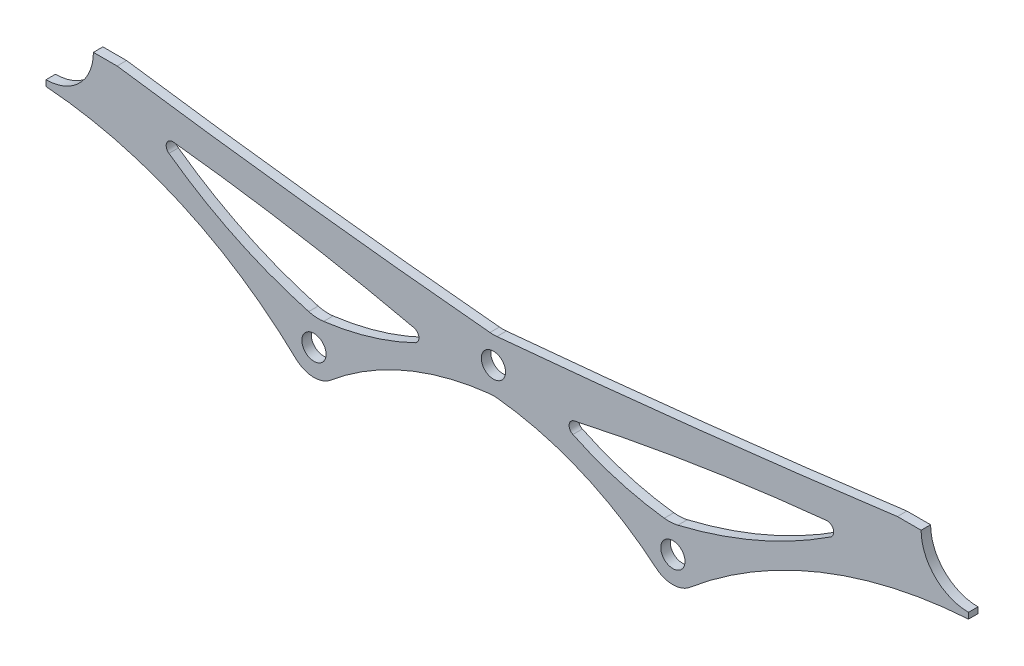
ISO-10303-21;
HEADER;
FILE_DESCRIPTION(('STEP AP214'),'2;1');
FILE_NAME('part.step','',(''),(''),'','','');
FILE_SCHEMA(('AUTOMOTIVE_DESIGN { 1 0 10303 214 1 1 1 1 }'));
ENDSEC;
DATA;
#1=APPLICATION_CONTEXT('core data for automotive mechanical design processes');
#2=APPLICATION_PROTOCOL_DEFINITION('international standard','automotive_design',2000,#1);
#3=PRODUCT_CONTEXT('',#1,'mechanical');
#4=PRODUCT('Part','Part','',(#3));
#5=PRODUCT_RELATED_PRODUCT_CATEGORY('part','',(#4));
#6=PRODUCT_DEFINITION_FORMATION('','',#4);
#7=PRODUCT_DEFINITION_CONTEXT('part definition',#1,'design');
#8=PRODUCT_DEFINITION('design','',#6,#7);
#9=PRODUCT_DEFINITION_SHAPE('','',#8);
#10=(LENGTH_UNIT() NAMED_UNIT(*) SI_UNIT(.MILLI.,.METRE.));
#11=(NAMED_UNIT(*) PLANE_ANGLE_UNIT() SI_UNIT($,.RADIAN.));
#12=(NAMED_UNIT(*) SI_UNIT($,.STERADIAN.) SOLID_ANGLE_UNIT());
#13=UNCERTAINTY_MEASURE_WITH_UNIT(LENGTH_MEASURE(1.E-05),#10,'distance_accuracy_value','');
#14=(GEOMETRIC_REPRESENTATION_CONTEXT(3) GLOBAL_UNCERTAINTY_ASSIGNED_CONTEXT((#13)) GLOBAL_UNIT_ASSIGNED_CONTEXT((#10,
#11,#12)) REPRESENTATION_CONTEXT('',''));
#15=CARTESIAN_POINT('',(0.,0.,0.));
#16=DIRECTION('',(0.,0.,1.));
#17=DIRECTION('',(1.,0.,0.));
#18=AXIS2_PLACEMENT_3D('',#15,#16,#17);
#19=CARTESIAN_POINT('',(-1589.26362340832,394.110715879887,-15.24));
#20=DIRECTION('',(0.,0.,1.));
#21=DIRECTION('',(1.,0.,0.));
#22=AXIS2_PLACEMENT_3D('',#19,#20,#21);
#23=CYLINDRICAL_SURFACE('',#22,79.6451471180553);
#24=CARTESIAN_POINT('',(-1589.26362340832,394.110715879887,-15.24));
#25=DIRECTION('',(0.,0.,1.));
#26=DIRECTION('',(1.,0.,0.));
#27=AXIS2_PLACEMENT_3D('',#24,#25,#26);
#28=CIRCLE('',#27,79.6451471180553);
#29=CARTESIAN_POINT('',(-1579.08751414357,315.118334856851,-15.24));
#30=VERTEX_POINT('',#29);
#31=CARTESIAN_POINT('',(-1554.55386567045,322.42681129012,-15.24));
#32=VERTEX_POINT('',#31);
#33=EDGE_CURVE('E278',#30,#32,#28,.T.);
#34=ORIENTED_EDGE('',*,*,#33,.F.);
#35=DIRECTION('',(0.,0.,1.));
#36=VECTOR('',#35,1.);
#37=CARTESIAN_POINT('',(-1579.08751414357,315.118334856851,-15.24));
#38=LINE('',#37,#36);
#39=CARTESIAN_POINT('',(-1579.08751414357,315.118334856851,-12.7));
#40=VERTEX_POINT('',#39);
#41=EDGE_CURVE('E432',#30,#40,#38,.T.);
#42=ORIENTED_EDGE('',*,*,#41,.T.);
#43=CARTESIAN_POINT('',(-1589.26362340832,394.110715879887,-12.7));
#44=DIRECTION('',(0.,0.,1.));
#45=DIRECTION('',(1.,0.,0.));
#46=AXIS2_PLACEMENT_3D('',#43,#44,#45);
#47=CIRCLE('',#46,79.6451471180553);
#48=CARTESIAN_POINT('',(-1554.55386567045,322.42681129012,-12.7));
#49=VERTEX_POINT('',#48);
#50=EDGE_CURVE('E334',#40,#49,#47,.T.);
#51=ORIENTED_EDGE('',*,*,#50,.T.);
#52=DIRECTION('',(0.,0.,1.));
#53=VECTOR('',#52,1.);
#54=CARTESIAN_POINT('',(-1554.55386567045,322.42681129012,-15.24));
#55=LINE('',#54,#53);
#56=EDGE_CURVE('E393',#49,#32,#55,.F.);
#57=ORIENTED_EDGE('',*,*,#56,.T.);
#58=EDGE_LOOP('',(#34,#42,#51,#57));
#59=FACE_BOUND('',#58,.T.);
#60=ADVANCED_FACE('F36',(#59),#23,.F.);
#61=CARTESIAN_POINT('',(-1682.01321356351,-232.504268770263,-15.24));
#62=DIRECTION('',(0.,0.,1.));
#63=DIRECTION('',(1.,0.,0.));
#64=AXIS2_PLACEMENT_3D('',#61,#62,#63);
#65=CYLINDRICAL_SURFACE('',#64,572.545996749978);
#66=CARTESIAN_POINT('',(-1682.01321356351,-232.504268770263,-15.24));
#67=DIRECTION('',(0.,0.,1.));
#68=DIRECTION('',(1.,0.,0.));
#69=AXIS2_PLACEMENT_3D('',#66,#67,#68);
#70=CIRCLE('',#69,572.545996749978);
#71=CARTESIAN_POINT('',(-1619.30091568319,336.596852375176,-15.24));
#72=VERTEX_POINT('',#71);
#73=CARTESIAN_POINT('',(-1554.93409207859,325.760735754511,-15.24));
#74=VERTEX_POINT('',#73);
#75=EDGE_CURVE('E282',#72,#74,#70,.F.);
#76=ORIENTED_EDGE('',*,*,#75,.T.);
#77=DIRECTION('',(0.,0.,1.));
#78=VECTOR('',#77,1.);
#79=CARTESIAN_POINT('',(-1554.93409207859,325.760735754511,-15.24));
#80=LINE('',#79,#78);
#81=CARTESIAN_POINT('',(-1554.93409207859,325.760735754511,-12.7));
#82=VERTEX_POINT('',#81);
#83=EDGE_CURVE('E390',#74,#82,#80,.T.);
#84=ORIENTED_EDGE('',*,*,#83,.T.);
#85=CARTESIAN_POINT('',(-1682.01321356351,-232.504268770263,-12.7));
#86=DIRECTION('',(0.,0.,1.));
#87=DIRECTION('',(1.,0.,0.));
#88=AXIS2_PLACEMENT_3D('',#85,#86,#87);
#89=CIRCLE('',#88,572.545996749978);
#90=CARTESIAN_POINT('',(-1619.30091568319,336.596852375176,-12.7));
#91=VERTEX_POINT('',#90);
#92=EDGE_CURVE('E338',#91,#82,#89,.F.);
#93=ORIENTED_EDGE('',*,*,#92,.F.);
#94=DIRECTION('',(0.,0.,1.));
#95=VECTOR('',#94,1.);
#96=CARTESIAN_POINT('',(-1619.30091568319,336.596852375176,-15.24));
#97=LINE('',#96,#95);
#98=EDGE_CURVE('E388',#91,#72,#97,.F.);
#99=ORIENTED_EDGE('',*,*,#98,.T.);
#100=EDGE_LOOP('',(#76,#84,#93,#99));
#101=FACE_BOUND('',#100,.T.);
#102=ADVANCED_FACE('F494',(#101),#65,.F.);
#103=CARTESIAN_POINT('',(-1772.00777562842,2986.79725913332,-15.24));
#104=DIRECTION('',(0.,0.,1.));
#105=DIRECTION('',(1.,0.,0.));
#106=AXIS2_PLACEMENT_3D('',#103,#104,#105);
#107=CYLINDRICAL_SURFACE('',#106,2662.74889437228);
#108=CARTESIAN_POINT('',(-1772.00777562842,2986.79725913332,-15.24));
#109=DIRECTION('',(0.,0.,1.));
#110=DIRECTION('',(1.,0.,0.));
#111=AXIS2_PLACEMENT_3D('',#108,#109,#110);
#112=CIRCLE('',#111,2662.74889437228);
#113=CARTESIAN_POINT('',(-1532.65209851228,334.828078634972,-15.24));
#114=VERTEX_POINT('',#113);
#115=CARTESIAN_POINT('',(-1425.35097323638,346.710000000371,-15.24));
#116=VERTEX_POINT('',#115);
#117=EDGE_CURVE('E246',#114,#116,#112,.T.);
#118=ORIENTED_EDGE('',*,*,#117,.F.);
#119=DIRECTION('',(0.,0.,1.));
#120=VECTOR('',#119,1.);
#121=CARTESIAN_POINT('',(-1532.65209851228,334.828078634972,-15.24));
#122=LINE('',#121,#120);
#123=CARTESIAN_POINT('',(-1532.65209851228,334.828078634972,-12.7));
#124=VERTEX_POINT('',#123);
#125=EDGE_CURVE('E418',#114,#124,#122,.T.);
#126=ORIENTED_EDGE('',*,*,#125,.T.);
#127=CARTESIAN_POINT('',(-1772.00777562842,2986.79725913332,-12.7));
#128=DIRECTION('',(0.,0.,1.));
#129=DIRECTION('',(1.,0.,0.));
#130=AXIS2_PLACEMENT_3D('',#127,#128,#129);
#131=CIRCLE('',#130,2662.74889437228);
#132=CARTESIAN_POINT('',(-1425.35097323638,346.710000000371,-12.7));
#133=VERTEX_POINT('',#132);
#134=EDGE_CURVE('E301',#124,#133,#131,.T.);
#135=ORIENTED_EDGE('',*,*,#134,.T.);
#136=DIRECTION('',(0.,0.,1.));
#137=VECTOR('',#136,1.);
#138=CARTESIAN_POINT('',(-1425.35097323638,346.710000000371,-15.24));
#139=LINE('',#138,#137);
#140=EDGE_CURVE('E351',#116,#133,#139,.T.);
#141=ORIENTED_EDGE('',*,*,#140,.F.);
#142=EDGE_LOOP('',(#118,#126,#135,#141));
#143=FACE_BOUND('',#142,.T.);
#144=ADVANCED_FACE('F500',(#143),#107,.F.);
#145=CARTESIAN_POINT('',(0.,346.710000000371,-15.24));
#146=DIRECTION('',(0.,-1.,0.));
#147=DIRECTION('',(0.,0.,-1.));
#148=AXIS2_PLACEMENT_3D('',#145,#146,#147);
#149=PLANE('',#148);
#150=DIRECTION('',(1.,0.,0.));
#151=VECTOR('',#150,1.);
#152=CARTESIAN_POINT('',(0.,346.710000000371,-12.7));
#153=LINE('',#152,#151);
#154=CARTESIAN_POINT('',(-1419.00097323583,346.710000000371,-12.7));
#155=VERTEX_POINT('',#154);
#156=EDGE_CURVE('E332',#133,#155,#153,.T.);
#157=ORIENTED_EDGE('',*,*,#156,.T.);
#158=DIRECTION('',(0.,0.,1.));
#159=VECTOR('',#158,1.);
#160=CARTESIAN_POINT('',(-1419.00097323583,346.710000000371,-15.24));
#161=LINE('',#160,#159);
#162=CARTESIAN_POINT('',(-1419.00097323583,346.710000000371,-15.24));
#163=VERTEX_POINT('',#162);
#164=EDGE_CURVE('E355',#163,#155,#161,.T.);
#165=ORIENTED_EDGE('',*,*,#164,.F.);
#166=DIRECTION('',(1.,0.,0.));
#167=VECTOR('',#166,1.);
#168=CARTESIAN_POINT('',(0.,346.710000000371,-15.24));
#169=LINE('',#168,#167);
#170=EDGE_CURVE('E276',#116,#163,#169,.T.);
#171=ORIENTED_EDGE('',*,*,#170,.F.);
#172=ORIENTED_EDGE('',*,*,#140,.T.);
#173=EDGE_LOOP('',(#157,#165,#171,#172));
#174=FACE_BOUND('',#173,.T.);
#175=ADVANCED_FACE('F507',(#174),#149,.F.);
#176=CARTESIAN_POINT('',(-1406.30097323583,346.710000000371,-15.24));
#177=DIRECTION('',(0.,0.,1.));
#178=DIRECTION('',(1.,0.,0.));
#179=AXIS2_PLACEMENT_3D('',#176,#177,#178);
#180=CYLINDRICAL_SURFACE('',#179,12.7);
#181=CARTESIAN_POINT('',(-1406.30097323583,346.710000000371,-12.7));
#182=DIRECTION('',(0.,0.,1.));
#183=DIRECTION('',(1.,0.,0.));
#184=AXIS2_PLACEMENT_3D('',#181,#182,#183);
#185=CIRCLE('',#184,12.7);
#186=CARTESIAN_POINT('',(-1406.30097323583,334.01000000037,-12.7));
#187=VERTEX_POINT('',#186);
#188=EDGE_CURVE('E330',#155,#187,#185,.T.);
#189=ORIENTED_EDGE('',*,*,#188,.T.);
#190=DIRECTION('',(0.,0.,1.));
#191=VECTOR('',#190,1.);
#192=CARTESIAN_POINT('',(-1406.30097323583,334.01000000037,-15.24));
#193=LINE('',#192,#191);
#194=CARTESIAN_POINT('',(-1406.30097323583,334.01000000037,-15.24));
#195=VERTEX_POINT('',#194);
#196=EDGE_CURVE('E358',#195,#187,#193,.T.);
#197=ORIENTED_EDGE('',*,*,#196,.F.);
#198=CARTESIAN_POINT('',(-1406.30097323583,346.710000000371,-15.24));
#199=DIRECTION('',(0.,0.,1.));
#200=DIRECTION('',(1.,0.,0.));
#201=AXIS2_PLACEMENT_3D('',#198,#199,#200);
#202=CIRCLE('',#201,12.7);
#203=EDGE_CURVE('E274',#163,#195,#202,.T.);
#204=ORIENTED_EDGE('',*,*,#203,.F.);
#205=ORIENTED_EDGE('',*,*,#164,.T.);
#206=EDGE_LOOP('',(#189,#197,#204,#205));
#207=FACE_BOUND('',#206,.T.);
#208=ADVANCED_FACE('F510',(#207),#180,.F.);
#209=CARTESIAN_POINT('',(-1406.30097323588,1.96700185201819E-10,-15.24));
#210=DIRECTION('',(-1.,1.39870617275628E-13,0.));
#211=DIRECTION('',(-1.39870617275628E-13,-1.,0.));
#212=AXIS2_PLACEMENT_3D('',#209,#210,#211);
#213=PLANE('',#212);
#214=DIRECTION('',(-1.39870617275628E-13,-1.,0.));
#215=VECTOR('',#214,1.);
#216=CARTESIAN_POINT('',(-1406.30097323588,1.96700185201819E-10,-12.7));
#217=LINE('',#216,#215);
#218=CARTESIAN_POINT('',(-1406.30097323583,332.422500000371,-12.7));
#219=VERTEX_POINT('',#218);
#220=EDGE_CURVE('E327',#187,#219,#217,.T.);
#221=ORIENTED_EDGE('',*,*,#220,.T.);
#222=DIRECTION('',(0.,0.,1.));
#223=VECTOR('',#222,1.);
#224=CARTESIAN_POINT('',(-1406.30097323583,332.422500000371,-15.24));
#225=LINE('',#224,#223);
#226=CARTESIAN_POINT('',(-1406.30097323583,332.422500000371,-15.24));
#227=VERTEX_POINT('',#226);
#228=EDGE_CURVE('E361',#227,#219,#225,.T.);
#229=ORIENTED_EDGE('',*,*,#228,.F.);
#230=DIRECTION('',(-1.39870617275628E-13,-1.,0.));
#231=VECTOR('',#230,1.);
#232=CARTESIAN_POINT('',(-1406.30097323588,1.96700185201819E-10,-15.24));
#233=LINE('',#232,#231);
#234=EDGE_CURVE('E272',#195,#227,#233,.T.);
#235=ORIENTED_EDGE('',*,*,#234,.F.);
#236=ORIENTED_EDGE('',*,*,#196,.T.);
#237=EDGE_LOOP('',(#221,#229,#235,#236));
#238=FACE_BOUND('',#237,.T.);
#239=ADVANCED_FACE('F514',(#238),#213,.F.);
#240=CARTESIAN_POINT('',(-1398.20656311933,204.191606570756,-15.24));
#241=DIRECTION('',(0.,0.,1.));
#242=DIRECTION('',(1.,0.,0.));
#243=AXIS2_PLACEMENT_3D('',#240,#241,#242);
#244=CYLINDRICAL_SURFACE('',#243,128.486114054754);
#245=CARTESIAN_POINT('',(-1398.20656311933,204.191606570756,-12.7));
#246=DIRECTION('',(0.,0.,1.));
#247=DIRECTION('',(1.,0.,0.));
#248=AXIS2_PLACEMENT_3D('',#245,#246,#247);
#249=CIRCLE('',#248,128.486114054754);
#250=CARTESIAN_POINT('',(-1481.00079913627,302.44533925946,-12.7));
#251=VERTEX_POINT('',#250);
#252=EDGE_CURVE('E324',#251,#219,#249,.F.);
#253=ORIENTED_EDGE('',*,*,#252,.F.);
#254=DIRECTION('',(0.,0.,1.));
#255=VECTOR('',#254,1.);
#256=CARTESIAN_POINT('',(-1481.00079913627,302.44533925946,-15.24));
#257=LINE('',#256,#255);
#258=CARTESIAN_POINT('',(-1481.00079913627,302.44533925946,-15.24));
#259=VERTEX_POINT('',#258);
#260=EDGE_CURVE('E363',#259,#251,#257,.T.);
#261=ORIENTED_EDGE('',*,*,#260,.F.);
#262=CARTESIAN_POINT('',(-1398.20656311933,204.191606570756,-15.24));
#263=DIRECTION('',(0.,0.,1.));
#264=DIRECTION('',(1.,0.,0.));
#265=AXIS2_PLACEMENT_3D('',#262,#263,#264);
#266=CIRCLE('',#265,128.486114054754);
#267=EDGE_CURVE('E269',#259,#227,#266,.F.);
#268=ORIENTED_EDGE('',*,*,#267,.T.);
#269=ORIENTED_EDGE('',*,*,#228,.T.);
#270=EDGE_LOOP('',(#253,#261,#268,#269));
#271=FACE_BOUND('',#270,.T.);
#272=ADVANCED_FACE('F518',(#271),#244,.F.);
#273=CARTESIAN_POINT('',(-1485.51147841381,307.798261120945,-15.24));
#274=DIRECTION('',(0.,0.,1.));
#275=DIRECTION('',(1.,0.,0.));
#276=AXIS2_PLACEMENT_3D('',#273,#274,#275);
#277=CYLINDRICAL_SURFACE('',#276,6.99999999999989);
#278=CARTESIAN_POINT('',(-1485.51147841381,307.798261120945,-12.7));
#279=DIRECTION('',(0.,0.,1.));
#280=DIRECTION('',(1.,0.,0.));
#281=AXIS2_PLACEMENT_3D('',#278,#279,#280);
#282=CIRCLE('',#281,6.99999999999989);
#283=CARTESIAN_POINT('',(-1490.00885770427,302.434160122852,-12.7));
#284=VERTEX_POINT('',#283);
#285=EDGE_CURVE('E321',#284,#251,#282,.T.);
#286=ORIENTED_EDGE('',*,*,#285,.F.);
#287=DIRECTION('',(0.,0.,1.));
#288=VECTOR('',#287,1.);
#289=CARTESIAN_POINT('',(-1490.00885770427,302.434160122852,-15.24));
#290=LINE('',#289,#288);
#291=CARTESIAN_POINT('',(-1490.00885770427,302.434160122852,-15.24));
#292=VERTEX_POINT('',#291);
#293=EDGE_CURVE('E365',#292,#284,#290,.T.);
#294=ORIENTED_EDGE('',*,*,#293,.F.);
#295=CARTESIAN_POINT('',(-1485.51147841381,307.798261120945,-15.24));
#296=DIRECTION('',(0.,0.,1.));
#297=DIRECTION('',(1.,0.,0.));
#298=AXIS2_PLACEMENT_3D('',#295,#296,#297);
#299=CIRCLE('',#298,6.99999999999989);
#300=EDGE_CURVE('E266',#292,#259,#299,.T.);
#301=ORIENTED_EDGE('',*,*,#300,.T.);
#302=ORIENTED_EDGE('',*,*,#260,.T.);
#303=EDGE_LOOP('',(#286,#294,#301,#302));
#304=FACE_BOUND('',#303,.T.);
#305=ADVANCED_FACE('F522',(#304),#277,.T.);
#306=CARTESIAN_POINT('',(-1541.18074424907,241.400578127316,-15.24));
#307=DIRECTION('',(0.,0.,1.));
#308=DIRECTION('',(1.,0.,0.));
#309=AXIS2_PLACEMENT_3D('',#306,#307,#308);
#310=CYLINDRICAL_SURFACE('',#309,79.6470972714014);
#311=CARTESIAN_POINT('',(-1541.18074424907,241.400578127316,-12.7));
#312=DIRECTION('',(0.,0.,1.));
#313=DIRECTION('',(1.,0.,0.));
#314=AXIS2_PLACEMENT_3D('',#311,#312,#313);
#315=CIRCLE('',#314,79.6470972714014);
#316=CARTESIAN_POINT('',(-1532.48591448475,320.571658953142,-12.7));
#317=VERTEX_POINT('',#316);
#318=EDGE_CURVE('E319',#317,#284,#315,.F.);
#319=ORIENTED_EDGE('',*,*,#318,.F.);
#320=DIRECTION('',(0.,0.,1.));
#321=VECTOR('',#320,1.);
#322=CARTESIAN_POINT('',(-1532.48591448475,320.571658953142,-15.24));
#323=LINE('',#322,#321);
#324=CARTESIAN_POINT('',(-1532.48591448475,320.571658953142,-15.24));
#325=VERTEX_POINT('',#324);
#326=EDGE_CURVE('E425',#317,#325,#323,.F.);
#327=ORIENTED_EDGE('',*,*,#326,.T.);
#328=CARTESIAN_POINT('',(-1541.18074424907,241.400578127316,-15.24));
#329=DIRECTION('',(0.,0.,1.));
#330=DIRECTION('',(1.,0.,0.));
#331=AXIS2_PLACEMENT_3D('',#328,#329,#330);
#332=CIRCLE('',#331,79.6470972714014);
#333=EDGE_CURVE('E264',#325,#292,#332,.F.);
#334=ORIENTED_EDGE('',*,*,#333,.T.);
#335=ORIENTED_EDGE('',*,*,#293,.T.);
#336=EDGE_LOOP('',(#319,#327,#334,#335));
#337=FACE_BOUND('',#336,.T.);
#338=ADVANCED_FACE('F526',(#337),#310,.F.);
#339=CARTESIAN_POINT('',(-1526.00944124424,241.402530743223,-15.24));
#340=DIRECTION('',(0.,0.,1.));
#341=DIRECTION('',(1.,0.,0.));
#342=AXIS2_PLACEMENT_3D('',#339,#340,#341);
#343=CYLINDRICAL_SURFACE('',#342,79.645147118986);
#344=CARTESIAN_POINT('',(-1526.00944124424,241.402530743223,-15.24));
#345=DIRECTION('',(0.,0.,1.));
#346=DIRECTION('',(1.,0.,0.));
#347=AXIS2_PLACEMENT_3D('',#344,#345,#346);
#348=CIRCLE('',#347,79.645147118986);
#349=CARTESIAN_POINT('',(-1577.18057721237,302.434197141382,-15.24));
#350=VERTEX_POINT('',#349);
#351=CARTESIAN_POINT('',(-1534.70420547118,320.571656888728,-15.24));
#352=VERTEX_POINT('',#351);
#353=EDGE_CURVE('E261',#350,#352,#348,.F.);
#354=ORIENTED_EDGE('',*,*,#353,.T.);
#355=DIRECTION('',(0.,0.,1.));
#356=VECTOR('',#355,1.);
#357=CARTESIAN_POINT('',(-1534.70420547118,320.571656888728,-15.24));
#358=LINE('',#357,#356);
#359=CARTESIAN_POINT('',(-1534.70420547118,320.571656888728,-12.7));
#360=VERTEX_POINT('',#359);
#361=EDGE_CURVE('E422',#352,#360,#358,.T.);
#362=ORIENTED_EDGE('',*,*,#361,.T.);
#363=CARTESIAN_POINT('',(-1526.00944124424,241.402530743223,-12.7));
#364=DIRECTION('',(0.,0.,1.));
#365=DIRECTION('',(1.,0.,0.));
#366=AXIS2_PLACEMENT_3D('',#363,#364,#365);
#367=CIRCLE('',#366,79.645147118986);
#368=CARTESIAN_POINT('',(-1577.18057721237,302.434197141382,-12.7));
#369=VERTEX_POINT('',#368);
#370=EDGE_CURVE('E316',#369,#360,#367,.F.);
#371=ORIENTED_EDGE('',*,*,#370,.F.);
#372=DIRECTION('',(0.,0.,1.));
#373=VECTOR('',#372,1.);
#374=CARTESIAN_POINT('',(-1577.18057721237,302.434197141382,-15.24));
#375=LINE('',#374,#373);
#376=EDGE_CURVE('E368',#350,#369,#375,.T.);
#377=ORIENTED_EDGE('',*,*,#376,.F.);
#378=EDGE_LOOP('',(#354,#362,#371,#377));
#379=FACE_BOUND('',#378,.T.);
#380=ADVANCED_FACE('F530',(#379),#343,.F.);
#381=CARTESIAN_POINT('',(-1581.6780006554,307.798261120682,-15.24));
#382=DIRECTION('',(0.,0.,1.));
#383=DIRECTION('',(1.,0.,0.));
#384=AXIS2_PLACEMENT_3D('',#381,#382,#383);
#385=CYLINDRICAL_SURFACE('',#384,6.99999999999992);
#386=CARTESIAN_POINT('',(-1581.6780006554,307.798261120682,-12.7));
#387=DIRECTION('',(0.,0.,1.));
#388=DIRECTION('',(1.,0.,0.));
#389=AXIS2_PLACEMENT_3D('',#386,#387,#388);
#390=CIRCLE('',#389,6.99999999999992);
#391=CARTESIAN_POINT('',(-1586.50049981143,302.724455656326,-12.7));
#392=VERTEX_POINT('',#391);
#393=EDGE_CURVE('E313',#392,#369,#390,.T.);
#394=ORIENTED_EDGE('',*,*,#393,.F.);
#395=DIRECTION('',(0.,0.,1.));
#396=VECTOR('',#395,1.);
#397=CARTESIAN_POINT('',(-1586.50049981143,302.724455656326,-15.24));
#398=LINE('',#397,#396);
#399=CARTESIAN_POINT('',(-1586.50049981143,302.724455656326,-15.24));
#400=VERTEX_POINT('',#399);
#401=EDGE_CURVE('E370',#400,#392,#398,.T.);
#402=ORIENTED_EDGE('',*,*,#401,.F.);
#403=CARTESIAN_POINT('',(-1581.6780006554,307.798261120682,-15.24));
#404=DIRECTION('',(0.,0.,1.));
#405=DIRECTION('',(1.,0.,0.));
#406=AXIS2_PLACEMENT_3D('',#403,#404,#405);
#407=CIRCLE('',#406,6.99999999999992);
#408=EDGE_CURVE('E258',#400,#350,#407,.T.);
#409=ORIENTED_EDGE('',*,*,#408,.T.);
#410=ORIENTED_EDGE('',*,*,#376,.T.);
#411=EDGE_LOOP('',(#394,#402,#409,#410));
#412=FACE_BOUND('',#411,.T.);
#413=ADVANCED_FACE('F534',(#412),#385,.T.);
#414=CARTESIAN_POINT('',(-1661.61634272742,223.694234619835,-15.24));
#415=DIRECTION('',(0.,0.,1.));
#416=DIRECTION('',(1.,0.,0.));
#417=AXIS2_PLACEMENT_3D('',#414,#415,#416);
#418=CYLINDRICAL_SURFACE('',#417,109.032865201537);
#419=CARTESIAN_POINT('',(-1661.61634272742,223.694234619835,-12.7));
#420=DIRECTION('',(0.,0.,1.));
#421=DIRECTION('',(1.,0.,0.));
#422=AXIS2_PLACEMENT_3D('',#419,#420,#421);
#423=CIRCLE('',#422,109.032865201537);
#424=CARTESIAN_POINT('',(-1653.4720194654,332.422500000371,-12.7));
#425=VERTEX_POINT('',#424);
#426=EDGE_CURVE('E310',#425,#392,#423,.F.);
#427=ORIENTED_EDGE('',*,*,#426,.F.);
#428=DIRECTION('',(0.,0.,1.));
#429=VECTOR('',#428,1.);
#430=CARTESIAN_POINT('',(-1653.4720194654,332.422500000371,-15.24));
#431=LINE('',#430,#429);
#432=CARTESIAN_POINT('',(-1653.4720194654,332.422500000371,-15.24));
#433=VERTEX_POINT('',#432);
#434=EDGE_CURVE('E372',#433,#425,#431,.T.);
#435=ORIENTED_EDGE('',*,*,#434,.F.);
#436=CARTESIAN_POINT('',(-1661.61634272742,223.694234619835,-15.24));
#437=DIRECTION('',(0.,0.,1.));
#438=DIRECTION('',(1.,0.,0.));
#439=AXIS2_PLACEMENT_3D('',#436,#437,#438);
#440=CIRCLE('',#439,109.032865201537);
#441=EDGE_CURVE('E255',#433,#400,#440,.F.);
#442=ORIENTED_EDGE('',*,*,#441,.T.);
#443=ORIENTED_EDGE('',*,*,#401,.T.);
#444=EDGE_LOOP('',(#427,#435,#442,#443));
#445=FACE_BOUND('',#444,.T.);
#446=ADVANCED_FACE('F538',(#445),#418,.F.);
#447=CARTESIAN_POINT('',(-1653.4720194654,0.,-15.24));
#448=DIRECTION('',(1.,0.,0.));
#449=DIRECTION('',(0.,0.,-1.));
#450=AXIS2_PLACEMENT_3D('',#447,#448,#449);
#451=PLANE('',#450);
#452=DIRECTION('',(0.,1.,0.));
#453=VECTOR('',#452,1.);
#454=CARTESIAN_POINT('',(-1653.4720194654,0.,-12.7));
#455=LINE('',#454,#453);
#456=CARTESIAN_POINT('',(-1653.4720194654,334.009999999825,-12.7));
#457=VERTEX_POINT('',#456);
#458=EDGE_CURVE('E308',#425,#457,#455,.T.);
#459=ORIENTED_EDGE('',*,*,#458,.T.);
#460=DIRECTION('',(0.,0.,1.));
#461=VECTOR('',#460,1.);
#462=CARTESIAN_POINT('',(-1653.4720194654,334.009999999825,-15.24));
#463=LINE('',#462,#461);
#464=CARTESIAN_POINT('',(-1653.4720194654,334.009999999825,-15.24));
#465=VERTEX_POINT('',#464);
#466=EDGE_CURVE('E374',#465,#457,#463,.T.);
#467=ORIENTED_EDGE('',*,*,#466,.F.);
#468=DIRECTION('',(0.,1.,0.));
#469=VECTOR('',#468,1.);
#470=CARTESIAN_POINT('',(-1653.4720194654,0.,-15.24));
#471=LINE('',#470,#469);
#472=EDGE_CURVE('E253',#433,#465,#471,.T.);
#473=ORIENTED_EDGE('',*,*,#472,.F.);
#474=ORIENTED_EDGE('',*,*,#434,.T.);
#475=EDGE_LOOP('',(#459,#467,#473,#474));
#476=FACE_BOUND('',#475,.T.);
#477=ADVANCED_FACE('F542',(#476),#451,.F.);
#478=CARTESIAN_POINT('',(-1653.4720194654,346.710000000371,-15.24));
#479=DIRECTION('',(0.,0.,1.));
#480=DIRECTION('',(1.,0.,0.));
#481=AXIS2_PLACEMENT_3D('',#478,#479,#480);
#482=CYLINDRICAL_SURFACE('',#481,12.7000000005457);
#483=CARTESIAN_POINT('',(-1653.4720194654,346.710000000371,-12.7));
#484=DIRECTION('',(0.,0.,1.));
#485=DIRECTION('',(1.,0.,0.));
#486=AXIS2_PLACEMENT_3D('',#483,#484,#485);
#487=CIRCLE('',#486,12.7000000005457);
#488=CARTESIAN_POINT('',(-1640.77201946486,346.710000000371,-12.7));
#489=VERTEX_POINT('',#488);
#490=EDGE_CURVE('E306',#457,#489,#487,.T.);
#491=ORIENTED_EDGE('',*,*,#490,.T.);
#492=DIRECTION('',(0.,0.,1.));
#493=VECTOR('',#492,1.);
#494=CARTESIAN_POINT('',(-1640.77201946486,346.710000000371,-15.24));
#495=LINE('',#494,#493);
#496=CARTESIAN_POINT('',(-1640.77201946486,346.710000000371,-15.24));
#497=VERTEX_POINT('',#496);
#498=EDGE_CURVE('E240',#497,#489,#495,.T.);
#499=ORIENTED_EDGE('',*,*,#498,.F.);
#500=CARTESIAN_POINT('',(-1653.4720194654,346.710000000371,-15.24));
#501=DIRECTION('',(0.,0.,1.));
#502=DIRECTION('',(1.,0.,0.));
#503=AXIS2_PLACEMENT_3D('',#500,#501,#502);
#504=CIRCLE('',#503,12.7000000005457);
#505=EDGE_CURVE('E227',#465,#497,#504,.T.);
#506=ORIENTED_EDGE('',*,*,#505,.F.);
#507=ORIENTED_EDGE('',*,*,#466,.T.);
#508=EDGE_LOOP('',(#491,#499,#506,#507));
#509=FACE_BOUND('',#508,.T.);
#510=ADVANCED_FACE('F546',(#509),#482,.F.);
#511=CARTESIAN_POINT('',(3.03090885722975E-12,346.710000000356,-15.24));
#512=DIRECTION('',(0.,-1.,0.));
#513=DIRECTION('',(1.,0.,0.));
#514=AXIS2_PLACEMENT_3D('',#511,#512,#513);
#515=PLANE('',#514);
#516=DIRECTION('',(1.,0.,0.));
#517=VECTOR('',#516,1.);
#518=CARTESIAN_POINT('',(3.03090885722975E-12,346.710000000356,-12.7));
#519=LINE('',#518,#517);
#520=CARTESIAN_POINT('',(-1634.42201946486,346.71000000037,-12.7));
#521=VERTEX_POINT('',#520);
#522=EDGE_CURVE('E236',#489,#521,#519,.T.);
#523=ORIENTED_EDGE('',*,*,#522,.T.);
#524=DIRECTION('',(0.,0.,1.));
#525=VECTOR('',#524,1.);
#526=CARTESIAN_POINT('',(-1634.42201946486,346.71000000037,-15.24));
#527=LINE('',#526,#525);
#528=CARTESIAN_POINT('',(-1634.42201946486,346.71000000037,-15.24));
#529=VERTEX_POINT('',#528);
#530=EDGE_CURVE('E233',#529,#521,#527,.T.);
#531=ORIENTED_EDGE('',*,*,#530,.F.);
#532=DIRECTION('',(1.,0.,0.));
#533=VECTOR('',#532,1.);
#534=CARTESIAN_POINT('',(3.03090885722975E-12,346.710000000356,-15.24));
#535=LINE('',#534,#533);
#536=EDGE_CURVE('E219',#497,#529,#535,.T.);
#537=ORIENTED_EDGE('',*,*,#536,.F.);
#538=ORIENTED_EDGE('',*,*,#498,.T.);
#539=EDGE_LOOP('',(#523,#531,#537,#538));
#540=FACE_BOUND('',#539,.T.);
#541=ADVANCED_FACE('F234',(#540),#515,.F.);
#542=CARTESIAN_POINT('',(-1514.7038691118,441.797040508538,-15.24));
#543=DIRECTION('',(0.,0.,1.));
#544=DIRECTION('',(1.,0.,0.));
#545=AXIS2_PLACEMENT_3D('',#542,#543,#544);
#546=CYLINDRICAL_SURFACE('',#545,130.141782663455);
#547=CARTESIAN_POINT('',(-1514.7038691118,441.797040508538,-15.24));
#548=DIRECTION('',(0.,0.,1.));
#549=DIRECTION('',(1.,0.,0.));
#550=AXIS2_PLACEMENT_3D('',#547,#548,#549);
#551=CIRCLE('',#550,130.141782663455);
#552=CARTESIAN_POINT('',(-1484.17292928241,315.287178015703,-15.24));
#553=VERTEX_POINT('',#552);
#554=CARTESIAN_POINT('',(-1443.22328265019,333.043146996968,-15.24));
#555=VERTEX_POINT('',#554);
#556=EDGE_CURVE('E350',#553,#555,#551,.T.);
#557=ORIENTED_EDGE('',*,*,#556,.F.);
#558=DIRECTION('',(0.,0.,1.));
#559=VECTOR('',#558,1.);
#560=CARTESIAN_POINT('',(-1484.17292928241,315.287178015703,-15.24));
#561=LINE('',#560,#559);
#562=CARTESIAN_POINT('',(-1484.17292928241,315.287178015703,-12.7));
#563=VERTEX_POINT('',#562);
#564=EDGE_CURVE('E427',#553,#563,#561,.T.);
#565=ORIENTED_EDGE('',*,*,#564,.T.);
#566=CARTESIAN_POINT('',(-1514.7038691118,441.797040508538,-12.7));
#567=DIRECTION('',(0.,0.,1.));
#568=DIRECTION('',(1.,0.,0.));
#569=AXIS2_PLACEMENT_3D('',#566,#567,#568);
#570=CIRCLE('',#569,130.141782663455);
#571=CARTESIAN_POINT('',(-1443.22328265019,333.043146996968,-12.7));
#572=VERTEX_POINT('',#571);
#573=EDGE_CURVE('E293',#563,#572,#570,.T.);
#574=ORIENTED_EDGE('',*,*,#573,.T.);
#575=DIRECTION('',(0.,0.,1.));
#576=VECTOR('',#575,1.);
#577=CARTESIAN_POINT('',(-1443.22328265019,333.043146996968,-15.24));
#578=LINE('',#577,#576);
#579=EDGE_CURVE('E382',#572,#555,#578,.F.);
#580=ORIENTED_EDGE('',*,*,#579,.T.);
#581=EDGE_LOOP('',(#557,#565,#574,#580));
#582=FACE_BOUND('',#581,.T.);
#583=ADVANCED_FACE('F457',(#582),#546,.F.);
#584=CARTESIAN_POINT('',(-1383.73517132049,-265.718137051282,-15.24));
#585=DIRECTION('',(0.,0.,1.));
#586=DIRECTION('',(1.,0.,0.));
#587=AXIS2_PLACEMENT_3D('',#584,#585,#586);
#588=CYLINDRICAL_SURFACE('',#587,605.062789571794);
#589=CARTESIAN_POINT('',(-1383.73517132049,-265.718137051282,-15.24));
#590=DIRECTION('',(0.,0.,1.));
#591=DIRECTION('',(1.,0.,0.));
#592=AXIS2_PLACEMENT_3D('',#589,#590,#591);
#593=CIRCLE('',#592,605.062789571794);
#594=CARTESIAN_POINT('',(-1444.37805346476,336.297992441639,-15.24));
#595=VERTEX_POINT('',#594);
#596=CARTESIAN_POINT('',(-1511.91831479088,325.610926207451,-15.24));
#597=VERTEX_POINT('',#596);
#598=EDGE_CURVE('E248',#595,#597,#593,.T.);
#599=ORIENTED_EDGE('',*,*,#598,.F.);
#600=DIRECTION('',(0.,0.,1.));
#601=VECTOR('',#600,1.);
#602=CARTESIAN_POINT('',(-1444.37805346476,336.29799244164,-15.24));
#603=LINE('',#602,#601);
#604=CARTESIAN_POINT('',(-1444.37805346476,336.297992441639,-12.7));
#605=VERTEX_POINT('',#604);
#606=EDGE_CURVE('E379',#595,#605,#603,.T.);
#607=ORIENTED_EDGE('',*,*,#606,.T.);
#608=CARTESIAN_POINT('',(-1383.73517132049,-265.718137051282,-12.7));
#609=DIRECTION('',(0.,0.,1.));
#610=DIRECTION('',(1.,0.,0.));
#611=AXIS2_PLACEMENT_3D('',#608,#609,#610);
#612=CIRCLE('',#611,605.062789571794);
#613=CARTESIAN_POINT('',(-1511.91831479088,325.610926207451,-12.7));
#614=VERTEX_POINT('',#613);
#615=EDGE_CURVE('E298',#605,#614,#612,.T.);
#616=ORIENTED_EDGE('',*,*,#615,.T.);
#617=DIRECTION('',(0.,0.,1.));
#618=VECTOR('',#617,1.);
#619=CARTESIAN_POINT('',(-1511.91831479088,325.610926207451,-15.24));
#620=LINE('',#619,#618);
#621=EDGE_CURVE('E354',#614,#597,#620,.F.);
#622=ORIENTED_EDGE('',*,*,#621,.T.);
#623=EDGE_LOOP('',(#599,#607,#616,#622));
#624=FACE_BOUND('',#623,.T.);
#625=ADVANCED_FACE('F477',(#624),#588,.F.);
#626=CARTESIAN_POINT('',(-1533.59506399725,327.714985503354,-15.24));
#627=DIRECTION('',(0.,0.,1.));
#628=DIRECTION('',(1.,0.,0.));
#629=AXIS2_PLACEMENT_3D('',#626,#627,#628);
#630=CYLINDRICAL_SURFACE('',#629,3.25000000204203);
#631=CARTESIAN_POINT('',(-1533.59506399725,327.714985503354,-15.24));
#632=DIRECTION('',(0.,0.,1.));
#633=DIRECTION('',(1.,0.,0.));
#634=AXIS2_PLACEMENT_3D('',#631,#632,#633);
#635=CIRCLE('',#634,3.25000000204203);
#636=CARTESIAN_POINT('',(-1530.34506399521,327.714985503354,-15.24));
#637=VERTEX_POINT('',#636);
#638=EDGE_CURVE('E288',#637,#637,#635,.T.);
#639=ORIENTED_EDGE('',*,*,#638,.F.);
#640=EDGE_LOOP('',(#639));
#641=FACE_BOUND('',#640,.T.);
#642=CARTESIAN_POINT('',(-1533.59506399725,327.714985503354,-12.7));
#643=DIRECTION('',(0.,0.,1.));
#644=DIRECTION('',(1.,0.,0.));
#645=AXIS2_PLACEMENT_3D('',#642,#643,#644);
#646=CIRCLE('',#645,3.25000000204203);
#647=CARTESIAN_POINT('',(-1530.34506399521,327.714985503354,-12.7));
#648=VERTEX_POINT('',#647);
#649=EDGE_CURVE('E344',#648,#648,#646,.T.);
#650=ORIENTED_EDGE('',*,*,#649,.T.);
#651=EDGE_LOOP('',(#650));
#652=FACE_BOUND('',#651,.T.);
#653=ADVANCED_FACE('F560',(#641,#652),#630,.F.);
#654=CARTESIAN_POINT('',(-1485.51147841381,307.798261120945,-15.24));
#655=DIRECTION('',(0.,0.,1.));
#656=DIRECTION('',(1.,0.,0.));
#657=AXIS2_PLACEMENT_3D('',#654,#655,#656);
#658=CYLINDRICAL_SURFACE('',#657,3.24999999971178);
#659=CARTESIAN_POINT('',(-1485.51147841381,307.798261120945,-15.24));
#660=DIRECTION('',(0.,0.,1.));
#661=DIRECTION('',(1.,0.,0.));
#662=AXIS2_PLACEMENT_3D('',#659,#660,#661);
#663=CIRCLE('',#662,3.24999999971178);
#664=CARTESIAN_POINT('',(-1482.2614784141,307.798261120945,-15.24));
#665=VERTEX_POINT('',#664);
#666=EDGE_CURVE('E285',#665,#665,#663,.T.);
#667=ORIENTED_EDGE('',*,*,#666,.F.);
#668=EDGE_LOOP('',(#667));
#669=FACE_BOUND('',#668,.T.);
#670=CARTESIAN_POINT('',(-1485.51147841381,307.798261120945,-12.7));
#671=DIRECTION('',(0.,0.,1.));
#672=DIRECTION('',(1.,0.,0.));
#673=AXIS2_PLACEMENT_3D('',#670,#671,#672);
#674=CIRCLE('',#673,3.24999999971178);
#675=CARTESIAN_POINT('',(-1482.2614784141,307.798261120945,-12.7));
#676=VERTEX_POINT('',#675);
#677=EDGE_CURVE('E341',#676,#676,#674,.T.);
#678=ORIENTED_EDGE('',*,*,#677,.T.);
#679=EDGE_LOOP('',(#678));
#680=FACE_BOUND('',#679,.T.);
#681=ADVANCED_FACE('F581',(#669,#680),#658,.F.);
#682=CARTESIAN_POINT('',(-1551.97871667553,428.146769246531,-15.24));
#683=DIRECTION('',(0.,0.,1.));
#684=DIRECTION('',(1.,0.,0.));
#685=AXIS2_PLACEMENT_3D('',#682,#683,#684);
#686=CYLINDRICAL_SURFACE('',#685,116.958908018375);
#687=CARTESIAN_POINT('',(-1551.97871667553,428.146769246531,-12.7));
#688=DIRECTION('',(0.,0.,1.));
#689=DIRECTION('',(1.,0.,0.));
#690=AXIS2_PLACEMENT_3D('',#687,#688,#689);
#691=CIRCLE('',#690,116.958908018375);
#692=CARTESIAN_POINT('',(-1583.08804697381,315.401056542042,-12.7));
#693=VERTEX_POINT('',#692);
#694=CARTESIAN_POINT('',(-1620.5378953395,333.389050902472,-12.7));
#695=VERTEX_POINT('',#694);
#696=EDGE_CURVE('E336',#693,#695,#691,.F.);
#697=ORIENTED_EDGE('',*,*,#696,.F.);
#698=DIRECTION('',(0.,0.,1.));
#699=VECTOR('',#698,1.);
#700=CARTESIAN_POINT('',(-1583.08804697381,315.401056542042,-15.24));
#701=LINE('',#700,#699);
#702=CARTESIAN_POINT('',(-1583.08804697381,315.401056542042,-15.24));
#703=VERTEX_POINT('',#702);
#704=EDGE_CURVE('E57',#693,#703,#701,.F.);
#705=ORIENTED_EDGE('',*,*,#704,.T.);
#706=CARTESIAN_POINT('',(-1551.97871667553,428.146769246531,-15.24));
#707=DIRECTION('',(0.,0.,1.));
#708=DIRECTION('',(1.,0.,0.));
#709=AXIS2_PLACEMENT_3D('',#706,#707,#708);
#710=CIRCLE('',#709,116.958908018375);
#711=CARTESIAN_POINT('',(-1620.5378953395,333.389050902472,-15.24));
#712=VERTEX_POINT('',#711);
#713=EDGE_CURVE('E280',#703,#712,#710,.F.);
#714=ORIENTED_EDGE('',*,*,#713,.T.);
#715=DIRECTION('',(0.,0.,1.));
#716=VECTOR('',#715,1.);
#717=CARTESIAN_POINT('',(-1620.5378953395,333.389050902472,-15.24));
#718=LINE('',#717,#716);
#719=EDGE_CURVE('E396',#712,#695,#718,.T.);
#720=ORIENTED_EDGE('',*,*,#719,.T.);
#721=EDGE_LOOP('',(#697,#705,#714,#720));
#722=FACE_BOUND('',#721,.T.);
#723=ADVANCED_FACE('F506',(#722),#686,.F.);
#724=CARTESIAN_POINT('',(-1344.94590531772,2355.32092590507,-15.24));
#725=DIRECTION('',(0.,0.,1.));
#726=DIRECTION('',(1.,0.,0.));
#727=AXIS2_PLACEMENT_3D('',#724,#725,#726);
#728=CYLINDRICAL_SURFACE('',#727,2029.36302132602);
#729=CARTESIAN_POINT('',(-1344.94590531772,2355.32092590507,-12.7));
#730=DIRECTION('',(0.,0.,1.));
#731=DIRECTION('',(1.,0.,0.));
#732=AXIS2_PLACEMENT_3D('',#729,#730,#731);
#733=CIRCLE('',#732,2029.36302132602);
#734=CARTESIAN_POINT('',(-1534.51445982169,334.831372487697,-12.7));
#735=VERTEX_POINT('',#734);
#736=EDGE_CURVE('E303',#521,#735,#733,.T.);
#737=ORIENTED_EDGE('',*,*,#736,.T.);
#738=DIRECTION('',(0.,0.,1.));
#739=VECTOR('',#738,1.);
#740=CARTESIAN_POINT('',(-1534.51445982169,334.831372487697,-15.24));
#741=LINE('',#740,#739);
#742=CARTESIAN_POINT('',(-1534.51445982169,334.831372487697,-15.24));
#743=VERTEX_POINT('',#742);
#744=EDGE_CURVE('E245',#735,#743,#741,.F.);
#745=ORIENTED_EDGE('',*,*,#744,.T.);
#746=CARTESIAN_POINT('',(-1344.94590531772,2355.32092590507,-15.24));
#747=DIRECTION('',(0.,0.,1.));
#748=DIRECTION('',(1.,0.,0.));
#749=AXIS2_PLACEMENT_3D('',#746,#747,#748);
#750=CIRCLE('',#749,2029.36302132602);
#751=EDGE_CURVE('E224',#529,#743,#750,.T.);
#752=ORIENTED_EDGE('',*,*,#751,.F.);
#753=ORIENTED_EDGE('',*,*,#530,.T.);
#754=EDGE_LOOP('',(#737,#745,#752,#753));
#755=FACE_BOUND('',#754,.T.);
#756=ADVANCED_FACE('F243',(#755),#728,.F.);
#757=CARTESIAN_POINT('',(-1477.92579816198,394.112668496984,-15.24));
#758=DIRECTION('',(0.,0.,1.));
#759=DIRECTION('',(1.,0.,0.));
#760=AXIS2_PLACEMENT_3D('',#757,#758,#759);
#761=CYLINDRICAL_SURFACE('',#760,79.6470972714022);
#762=CARTESIAN_POINT('',(-1477.92579816198,394.112668496984,-12.7));
#763=DIRECTION('',(0.,0.,1.));
#764=DIRECTION('',(1.,0.,0.));
#765=AXIS2_PLACEMENT_3D('',#762,#763,#764);
#766=CIRCLE('',#765,79.6470972714022);
#767=CARTESIAN_POINT('',(-1512.30920078826,322.269493959663,-12.7));
#768=VERTEX_POINT('',#767);
#769=CARTESIAN_POINT('',(-1487.81836248094,315.082311829717,-12.7));
#770=VERTEX_POINT('',#769);
#771=EDGE_CURVE('E295',#768,#770,#766,.T.);
#772=ORIENTED_EDGE('',*,*,#771,.T.);
#773=DIRECTION('',(0.,0.,1.));
#774=VECTOR('',#773,1.);
#775=CARTESIAN_POINT('',(-1487.81836248094,315.082311829717,-15.24));
#776=LINE('',#775,#774);
#777=CARTESIAN_POINT('',(-1487.81836248094,315.082311829717,-15.24));
#778=VERTEX_POINT('',#777);
#779=EDGE_CURVE('E430',#770,#778,#776,.F.);
#780=ORIENTED_EDGE('',*,*,#779,.T.);
#781=CARTESIAN_POINT('',(-1477.92579816198,394.112668496984,-15.24));
#782=DIRECTION('',(0.,0.,1.));
#783=DIRECTION('',(1.,0.,0.));
#784=AXIS2_PLACEMENT_3D('',#781,#782,#783);
#785=CIRCLE('',#784,79.6470972714022);
#786=CARTESIAN_POINT('',(-1512.30920078826,322.269493959663,-15.24));
#787=VERTEX_POINT('',#786);
#788=EDGE_CURVE('E452',#787,#778,#785,.T.);
#789=ORIENTED_EDGE('',*,*,#788,.F.);
#790=DIRECTION('',(0.,0.,1.));
#791=VECTOR('',#790,1.);
#792=CARTESIAN_POINT('',(-1512.30920078826,322.269493959663,-15.24));
#793=LINE('',#792,#791);
#794=EDGE_CURVE('E385',#787,#768,#793,.T.);
#795=ORIENTED_EDGE('',*,*,#794,.T.);
#796=EDGE_LOOP('',(#772,#780,#789,#795));
#797=FACE_BOUND('',#796,.T.);
#798=ADVANCED_FACE('F468',(#797),#761,.F.);
#799=CARTESIAN_POINT('',(-1581.67800065536,307.798261120682,-15.24));
#800=DIRECTION('',(0.,0.,1.));
#801=DIRECTION('',(1.,0.,0.));
#802=AXIS2_PLACEMENT_3D('',#799,#800,#801);
#803=CYLINDRICAL_SURFACE('',#802,3.24999999995427);
#804=CARTESIAN_POINT('',(-1581.67800065536,307.798261120682,-15.24));
#805=DIRECTION('',(0.,0.,1.));
#806=DIRECTION('',(1.,0.,0.));
#807=AXIS2_PLACEMENT_3D('',#804,#805,#806);
#808=CIRCLE('',#807,3.24999999995427);
#809=CARTESIAN_POINT('',(-1578.4280006554,307.798261120682,-15.24));
#810=VERTEX_POINT('',#809);
#811=EDGE_CURVE('E241',#810,#810,#808,.T.);
#812=ORIENTED_EDGE('',*,*,#811,.F.);
#813=EDGE_LOOP('',(#812));
#814=FACE_BOUND('',#813,.T.);
#815=CARTESIAN_POINT('',(-1581.67800065536,307.798261120682,-12.7));
#816=DIRECTION('',(0.,0.,1.));
#817=DIRECTION('',(1.,0.,0.));
#818=AXIS2_PLACEMENT_3D('',#815,#816,#817);
#819=CIRCLE('',#818,3.24999999995427);
#820=CARTESIAN_POINT('',(-1578.4280006554,307.798261120682,-12.7));
#821=VERTEX_POINT('',#820);
#822=EDGE_CURVE('E347',#821,#821,#819,.T.);
#823=ORIENTED_EDGE('',*,*,#822,.T.);
#824=EDGE_LOOP('',(#823));
#825=FACE_BOUND('',#824,.T.);
#826=ADVANCED_FACE('F562',(#814,#825),#803,.F.);
#827=CARTESIAN_POINT('',(0.,0.,-15.24));
#828=DIRECTION('',(0.,0.,1.));
#829=DIRECTION('',(1.,0.,0.));
#830=AXIS2_PLACEMENT_3D('',#827,#828,#829);
#831=PLANE('',#830);
#832=ORIENTED_EDGE('',*,*,#788,.T.);
#833=CARTESIAN_POINT('',(-1486.55644011435,325.163638723569,-15.24));
#834=DIRECTION('',(0.,0.,1.));
#835=DIRECTION('',(1.,0.,0.));
#836=AXIS2_PLACEMENT_3D('',#833,#834,#835);
#837=CIRCLE('',#836,10.16);
#838=EDGE_CURVE('E446',#778,#553,#837,.T.);
#839=ORIENTED_EDGE('',*,*,#838,.T.);
#840=ORIENTED_EDGE('',*,*,#556,.T.);
#841=CARTESIAN_POINT('',(-1444.1998520511,334.528945168057,-15.24));
#842=DIRECTION('',(0.,0.,1.));
#843=DIRECTION('',(1.,0.,0.));
#844=AXIS2_PLACEMENT_3D('',#841,#842,#843);
#845=CIRCLE('',#844,1.778);
#846=EDGE_CURVE('E402',#555,#595,#845,.T.);
#847=ORIENTED_EDGE('',*,*,#846,.T.);
#848=ORIENTED_EDGE('',*,*,#598,.T.);
#849=CARTESIAN_POINT('',(-1511.54164375273,323.873283284114,-15.24));
#850=DIRECTION('',(0.,0.,1.));
#851=DIRECTION('',(1.,0.,0.));
#852=AXIS2_PLACEMENT_3D('',#849,#850,#851);
#853=CIRCLE('',#852,1.778);
#854=EDGE_CURVE('E406',#597,#787,#853,.T.);
#855=ORIENTED_EDGE('',*,*,#854,.T.);
#856=EDGE_LOOP('',(#832,#839,#840,#847,#848,#855));
#857=FACE_BOUND('',#856,.T.);
#858=ORIENTED_EDGE('',*,*,#751,.T.);
#859=CARTESIAN_POINT('',(-1533.56538541089,344.946947496699,-15.24));
#860=DIRECTION('',(0.,0.,1.));
#861=DIRECTION('',(1.,0.,0.));
#862=AXIS2_PLACEMENT_3D('',#859,#860,#861);
#863=CIRCLE('',#862,10.16);
#864=EDGE_CURVE('E438',#743,#114,#863,.T.);
#865=ORIENTED_EDGE('',*,*,#864,.T.);
#866=ORIENTED_EDGE('',*,*,#117,.T.);
#867=ORIENTED_EDGE('',*,*,#170,.T.);
#868=ORIENTED_EDGE('',*,*,#203,.T.);
#869=ORIENTED_EDGE('',*,*,#234,.T.);
#870=ORIENTED_EDGE('',*,*,#267,.F.);
#871=ORIENTED_EDGE('',*,*,#300,.F.);
#872=ORIENTED_EDGE('',*,*,#333,.F.);
#873=CARTESIAN_POINT('',(-1533.59505057925,310.472380903505,-15.24));
#874=DIRECTION('',(0.,0.,1.));
#875=DIRECTION('',(1.,0.,0.));
#876=AXIS2_PLACEMENT_3D('',#873,#874,#875);
#877=CIRCLE('',#876,10.16);
#878=EDGE_CURVE('E442',#325,#352,#877,.T.);
#879=ORIENTED_EDGE('',*,*,#878,.T.);
#880=ORIENTED_EDGE('',*,*,#353,.F.);
#881=ORIENTED_EDGE('',*,*,#408,.F.);
#882=ORIENTED_EDGE('',*,*,#441,.F.);
#883=ORIENTED_EDGE('',*,*,#472,.T.);
#884=ORIENTED_EDGE('',*,*,#505,.T.);
#885=ORIENTED_EDGE('',*,*,#536,.T.);
#886=EDGE_LOOP('',(#858,#865,#866,#867,#868,#869,#870,#871,#872,#879,#880,#881,#882,#883,#884,#885));
#887=FACE_BOUND('',#886,.T.);
#888=ORIENTED_EDGE('',*,*,#713,.F.);
#889=CARTESIAN_POINT('',(-1580.38563805784,325.195064202387,-15.24));
#890=DIRECTION('',(0.,0.,1.));
#891=DIRECTION('',(1.,0.,0.));
#892=AXIS2_PLACEMENT_3D('',#889,#890,#891);
#893=CIRCLE('',#892,10.16);
#894=EDGE_CURVE('E11',#703,#30,#893,.T.);
#895=ORIENTED_EDGE('',*,*,#894,.T.);
#896=ORIENTED_EDGE('',*,*,#33,.T.);
#897=CARTESIAN_POINT('',(-1555.32872705863,324.027084338417,-15.24));
#898=DIRECTION('',(0.,0.,1.));
#899=DIRECTION('',(1.,0.,0.));
#900=AXIS2_PLACEMENT_3D('',#897,#898,#899);
#901=CIRCLE('',#900,1.778);
#902=EDGE_CURVE('E411',#32,#74,#901,.T.);
#903=ORIENTED_EDGE('',*,*,#902,.T.);
#904=ORIENTED_EDGE('',*,*,#75,.F.);
#905=CARTESIAN_POINT('',(-1619.49566416849,334.829550186111,-15.24));
#906=DIRECTION('',(0.,0.,1.));
#907=DIRECTION('',(1.,0.,0.));
#908=AXIS2_PLACEMENT_3D('',#905,#906,#907);
#909=CIRCLE('',#908,1.778);
#910=EDGE_CURVE('E415',#72,#712,#909,.T.);
#911=ORIENTED_EDGE('',*,*,#910,.T.);
#912=EDGE_LOOP('',(#888,#895,#896,#903,#904,#911));
#913=FACE_BOUND('',#912,.T.);
#914=ORIENTED_EDGE('',*,*,#666,.T.);
#915=EDGE_LOOP('',(#914));
#916=FACE_BOUND('',#915,.T.);
#917=ORIENTED_EDGE('',*,*,#638,.T.);
#918=EDGE_LOOP('',(#917));
#919=FACE_BOUND('',#918,.T.);
#920=ORIENTED_EDGE('',*,*,#811,.T.);
#921=EDGE_LOOP('',(#920));
#922=FACE_BOUND('',#921,.T.);
#923=ADVANCED_FACE('F221',(#857,#887,#913,#916,#919,#922),#831,.F.);
#924=CARTESIAN_POINT('',(0.,0.,-12.7));
#925=DIRECTION('',(0.,0.,1.));
#926=DIRECTION('',(1.,0.,0.));
#927=AXIS2_PLACEMENT_3D('',#924,#925,#926);
#928=PLANE('',#927);
#929=ORIENTED_EDGE('',*,*,#573,.F.);
#930=CARTESIAN_POINT('',(-1486.55644011435,325.163638723569,-12.7));
#931=DIRECTION('',(0.,0.,1.));
#932=DIRECTION('',(1.,0.,0.));
#933=AXIS2_PLACEMENT_3D('',#930,#931,#932);
#934=CIRCLE('',#933,10.16);
#935=EDGE_CURVE('E444',#563,#770,#934,.F.);
#936=ORIENTED_EDGE('',*,*,#935,.T.);
#937=ORIENTED_EDGE('',*,*,#771,.F.);
#938=CARTESIAN_POINT('',(-1511.54164375273,323.873283284114,-12.7));
#939=DIRECTION('',(0.,0.,1.));
#940=DIRECTION('',(1.,0.,0.));
#941=AXIS2_PLACEMENT_3D('',#938,#939,#940);
#942=CIRCLE('',#941,1.778);
#943=EDGE_CURVE('E404',#768,#614,#942,.F.);
#944=ORIENTED_EDGE('',*,*,#943,.T.);
#945=ORIENTED_EDGE('',*,*,#615,.F.);
#946=CARTESIAN_POINT('',(-1444.1998520511,334.528945168057,-12.7));
#947=DIRECTION('',(0.,0.,1.));
#948=DIRECTION('',(1.,0.,0.));
#949=AXIS2_PLACEMENT_3D('',#946,#947,#948);
#950=CIRCLE('',#949,1.778);
#951=EDGE_CURVE('E399',#605,#572,#950,.F.);
#952=ORIENTED_EDGE('',*,*,#951,.T.);
#953=EDGE_LOOP('',(#929,#936,#937,#944,#945,#952));
#954=FACE_BOUND('',#953,.T.);
#955=ORIENTED_EDGE('',*,*,#134,.F.);
#956=CARTESIAN_POINT('',(-1533.56538541089,344.946947496699,-12.7));
#957=DIRECTION('',(0.,0.,1.));
#958=DIRECTION('',(1.,0.,0.));
#959=AXIS2_PLACEMENT_3D('',#956,#957,#958);
#960=CIRCLE('',#959,10.16);
#961=EDGE_CURVE('E436',#124,#735,#960,.F.);
#962=ORIENTED_EDGE('',*,*,#961,.T.);
#963=ORIENTED_EDGE('',*,*,#736,.F.);
#964=ORIENTED_EDGE('',*,*,#522,.F.);
#965=ORIENTED_EDGE('',*,*,#490,.F.);
#966=ORIENTED_EDGE('',*,*,#458,.F.);
#967=ORIENTED_EDGE('',*,*,#426,.T.);
#968=ORIENTED_EDGE('',*,*,#393,.T.);
#969=ORIENTED_EDGE('',*,*,#370,.T.);
#970=CARTESIAN_POINT('',(-1533.59505057925,310.472380903505,-12.7));
#971=DIRECTION('',(0.,0.,1.));
#972=DIRECTION('',(1.,0.,0.));
#973=AXIS2_PLACEMENT_3D('',#970,#971,#972);
#974=CIRCLE('',#973,10.16);
#975=EDGE_CURVE('E440',#360,#317,#974,.F.);
#976=ORIENTED_EDGE('',*,*,#975,.T.);
#977=ORIENTED_EDGE('',*,*,#318,.T.);
#978=ORIENTED_EDGE('',*,*,#285,.T.);
#979=ORIENTED_EDGE('',*,*,#252,.T.);
#980=ORIENTED_EDGE('',*,*,#220,.F.);
#981=ORIENTED_EDGE('',*,*,#188,.F.);
#982=ORIENTED_EDGE('',*,*,#156,.F.);
#983=EDGE_LOOP('',(#955,#962,#963,#964,#965,#966,#967,#968,#969,#976,#977,#978,#979,#980,#981,#982));
#984=FACE_BOUND('',#983,.T.);
#985=ORIENTED_EDGE('',*,*,#50,.F.);
#986=CARTESIAN_POINT('',(-1580.38563805784,325.195064202387,-12.7));
#987=DIRECTION('',(0.,0.,1.));
#988=DIRECTION('',(1.,0.,0.));
#989=AXIS2_PLACEMENT_3D('',#986,#987,#988);
#990=CIRCLE('',#989,10.16);
#991=EDGE_CURVE('E44',#40,#693,#990,.F.);
#992=ORIENTED_EDGE('',*,*,#991,.T.);
#993=ORIENTED_EDGE('',*,*,#696,.T.);
#994=CARTESIAN_POINT('',(-1619.49566416849,334.829550186111,-12.7));
#995=DIRECTION('',(0.,0.,1.));
#996=DIRECTION('',(1.,0.,0.));
#997=AXIS2_PLACEMENT_3D('',#994,#995,#996);
#998=CIRCLE('',#997,1.778);
#999=EDGE_CURVE('E413',#695,#91,#998,.F.);
#1000=ORIENTED_EDGE('',*,*,#999,.T.);
#1001=ORIENTED_EDGE('',*,*,#92,.T.);
#1002=CARTESIAN_POINT('',(-1555.32872705863,324.027084338417,-12.7));
#1003=DIRECTION('',(0.,0.,1.));
#1004=DIRECTION('',(1.,0.,0.));
#1005=AXIS2_PLACEMENT_3D('',#1002,#1003,#1004);
#1006=CIRCLE('',#1005,1.778);
#1007=EDGE_CURVE('E408',#82,#49,#1006,.F.);
#1008=ORIENTED_EDGE('',*,*,#1007,.T.);
#1009=EDGE_LOOP('',(#985,#992,#993,#1000,#1001,#1008));
#1010=FACE_BOUND('',#1009,.T.);
#1011=ORIENTED_EDGE('',*,*,#677,.F.);
#1012=EDGE_LOOP('',(#1011));
#1013=FACE_BOUND('',#1012,.T.);
#1014=ORIENTED_EDGE('',*,*,#649,.F.);
#1015=EDGE_LOOP('',(#1014));
#1016=FACE_BOUND('',#1015,.T.);
#1017=ORIENTED_EDGE('',*,*,#822,.F.);
#1018=EDGE_LOOP('',(#1017));
#1019=FACE_BOUND('',#1018,.T.);
#1020=ADVANCED_FACE('F465',(#954,#984,#1010,#1013,#1016,#1019),#928,.T.);
#1021=CARTESIAN_POINT('',(-1444.1998520511,334.528945168057,-15.24));
#1022=DIRECTION('',(0.,0.,-1.));
#1023=DIRECTION('',(-1.,0.,0.));
#1024=AXIS2_PLACEMENT_3D('',#1021,#1022,#1023);
#1025=CYLINDRICAL_SURFACE('',#1024,1.778);
#1026=ORIENTED_EDGE('',*,*,#846,.F.);
#1027=ORIENTED_EDGE('',*,*,#579,.F.);
#1028=ORIENTED_EDGE('',*,*,#951,.F.);
#1029=ORIENTED_EDGE('',*,*,#606,.F.);
#1030=EDGE_LOOP('',(#1026,#1027,#1028,#1029));
#1031=FACE_BOUND('',#1030,.T.);
#1032=ADVANCED_FACE('F481',(#1031),#1025,.F.);
#1033=CARTESIAN_POINT('',(-1511.54164375273,323.873283284114,-15.24));
#1034=DIRECTION('',(0.,0.,-1.));
#1035=DIRECTION('',(-1.,0.,0.));
#1036=AXIS2_PLACEMENT_3D('',#1033,#1034,#1035);
#1037=CYLINDRICAL_SURFACE('',#1036,1.778);
#1038=ORIENTED_EDGE('',*,*,#854,.F.);
#1039=ORIENTED_EDGE('',*,*,#621,.F.);
#1040=ORIENTED_EDGE('',*,*,#943,.F.);
#1041=ORIENTED_EDGE('',*,*,#794,.F.);
#1042=EDGE_LOOP('',(#1038,#1039,#1040,#1041));
#1043=FACE_BOUND('',#1042,.T.);
#1044=ADVANCED_FACE('F472',(#1043),#1037,.F.);
#1045=CARTESIAN_POINT('',(-1555.32872705863,324.027084338417,-15.24));
#1046=DIRECTION('',(0.,0.,-1.));
#1047=DIRECTION('',(-1.,0.,0.));
#1048=AXIS2_PLACEMENT_3D('',#1045,#1046,#1047);
#1049=CYLINDRICAL_SURFACE('',#1048,1.778);
#1050=ORIENTED_EDGE('',*,*,#902,.F.);
#1051=ORIENTED_EDGE('',*,*,#56,.F.);
#1052=ORIENTED_EDGE('',*,*,#1007,.F.);
#1053=ORIENTED_EDGE('',*,*,#83,.F.);
#1054=EDGE_LOOP('',(#1050,#1051,#1052,#1053));
#1055=FACE_BOUND('',#1054,.T.);
#1056=ADVANCED_FACE('F489',(#1055),#1049,.F.);
#1057=CARTESIAN_POINT('',(-1619.49566416849,334.829550186111,-15.24));
#1058=DIRECTION('',(0.,0.,-1.));
#1059=DIRECTION('',(-1.,0.,0.));
#1060=AXIS2_PLACEMENT_3D('',#1057,#1058,#1059);
#1061=CYLINDRICAL_SURFACE('',#1060,1.778);
#1062=ORIENTED_EDGE('',*,*,#910,.F.);
#1063=ORIENTED_EDGE('',*,*,#98,.F.);
#1064=ORIENTED_EDGE('',*,*,#999,.F.);
#1065=ORIENTED_EDGE('',*,*,#719,.F.);
#1066=EDGE_LOOP('',(#1062,#1063,#1064,#1065));
#1067=FACE_BOUND('',#1066,.T.);
#1068=ADVANCED_FACE('F632',(#1067),#1061,.F.);
#1069=CARTESIAN_POINT('',(-1533.56538541089,344.946947496699,-15.24));
#1070=DIRECTION('',(0.,0.,-1.));
#1071=DIRECTION('',(-1.,0.,0.));
#1072=AXIS2_PLACEMENT_3D('',#1069,#1070,#1071);
#1073=CYLINDRICAL_SURFACE('',#1072,10.16);
#1074=ORIENTED_EDGE('',*,*,#864,.F.);
#1075=ORIENTED_EDGE('',*,*,#744,.F.);
#1076=ORIENTED_EDGE('',*,*,#961,.F.);
#1077=ORIENTED_EDGE('',*,*,#125,.F.);
#1078=EDGE_LOOP('',(#1074,#1075,#1076,#1077));
#1079=FACE_BOUND('',#1078,.T.);
#1080=ADVANCED_FACE('F626',(#1079),#1073,.F.);
#1081=CARTESIAN_POINT('',(-1533.59505057925,310.472380903505,-15.24));
#1082=DIRECTION('',(0.,0.,-1.));
#1083=DIRECTION('',(-1.,0.,0.));
#1084=AXIS2_PLACEMENT_3D('',#1081,#1082,#1083);
#1085=CYLINDRICAL_SURFACE('',#1084,10.16);
#1086=ORIENTED_EDGE('',*,*,#878,.F.);
#1087=ORIENTED_EDGE('',*,*,#326,.F.);
#1088=ORIENTED_EDGE('',*,*,#975,.F.);
#1089=ORIENTED_EDGE('',*,*,#361,.F.);
#1090=EDGE_LOOP('',(#1086,#1087,#1088,#1089));
#1091=FACE_BOUND('',#1090,.T.);
#1092=ADVANCED_FACE('F631',(#1091),#1085,.F.);
#1093=CARTESIAN_POINT('',(-1486.55644011435,325.163638723569,-15.24));
#1094=DIRECTION('',(0.,0.,-1.));
#1095=DIRECTION('',(-1.,0.,0.));
#1096=AXIS2_PLACEMENT_3D('',#1093,#1094,#1095);
#1097=CYLINDRICAL_SURFACE('',#1096,10.16);
#1098=ORIENTED_EDGE('',*,*,#838,.F.);
#1099=ORIENTED_EDGE('',*,*,#779,.F.);
#1100=ORIENTED_EDGE('',*,*,#935,.F.);
#1101=ORIENTED_EDGE('',*,*,#564,.F.);
#1102=EDGE_LOOP('',(#1098,#1099,#1100,#1101));
#1103=FACE_BOUND('',#1102,.T.);
#1104=ADVANCED_FACE('F462',(#1103),#1097,.F.);
#1105=CARTESIAN_POINT('',(-1580.38563805784,325.195064202387,-15.24));
#1106=DIRECTION('',(0.,0.,-1.));
#1107=DIRECTION('',(-1.,0.,0.));
#1108=AXIS2_PLACEMENT_3D('',#1105,#1106,#1107);
#1109=CYLINDRICAL_SURFACE('',#1108,10.16);
#1110=ORIENTED_EDGE('',*,*,#894,.F.);
#1111=ORIENTED_EDGE('',*,*,#704,.F.);
#1112=ORIENTED_EDGE('',*,*,#991,.F.);
#1113=ORIENTED_EDGE('',*,*,#41,.F.);
#1114=EDGE_LOOP('',(#1110,#1111,#1112,#1113));
#1115=FACE_BOUND('',#1114,.T.);
#1116=ADVANCED_FACE('F38',(#1115),#1109,.F.);
#1117=CLOSED_SHELL('',(#60,#102,#144,#175,#208,#239,#272,#305,#338,#380,#413,#446,#477,#510,
#541,#583,#625,#653,#681,#723,#756,#798,#826,#923,#1020,#1032,#1044,#1056,#1068,#1080,#1092,
#1104,#1116));
#1118=MANIFOLD_SOLID_BREP('B2',#1117);
#1119=ADVANCED_BREP_SHAPE_REPRESENTATION('',(#18,#1118),#14);
#1120=SHAPE_DEFINITION_REPRESENTATION(#9,#1119);
ENDSEC;
END-ISO-10303-21;
